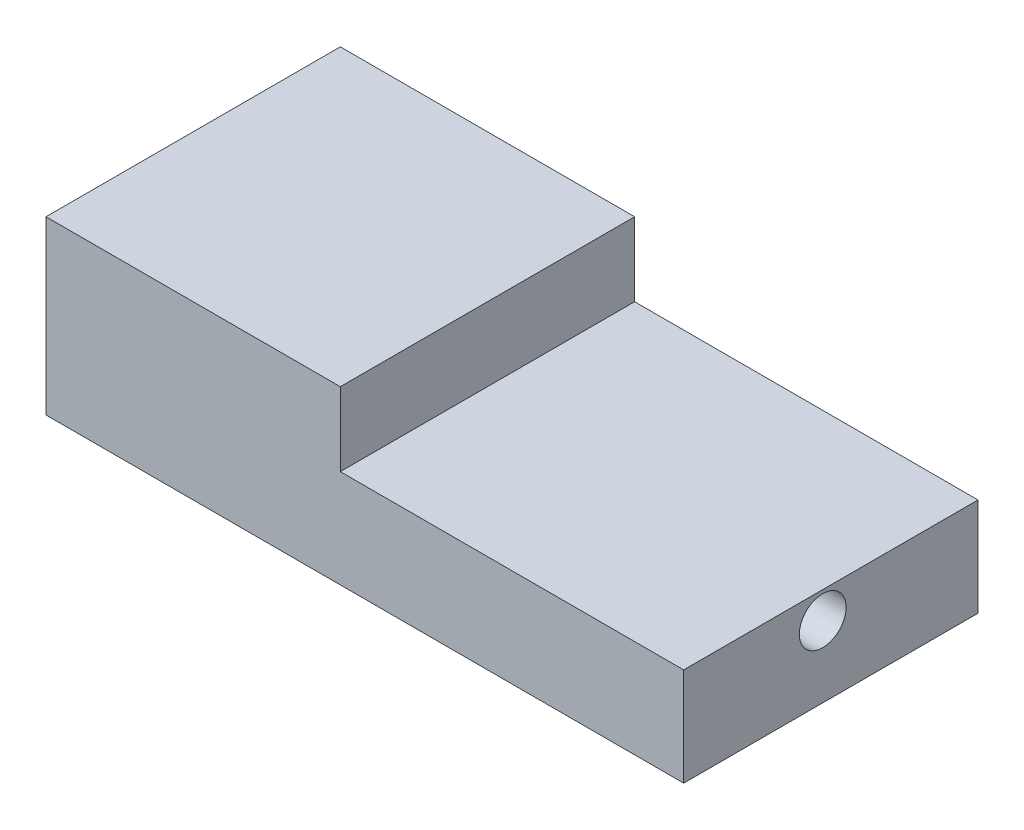
ISO-10303-21;
HEADER;
FILE_DESCRIPTION(('STEP AP214'),'2;1');
FILE_NAME('part.step','',(''),(''),'','','');
FILE_SCHEMA(('AUTOMOTIVE_DESIGN { 1 0 10303 214 1 1 1 1 }'));
ENDSEC;
DATA;
#1=APPLICATION_CONTEXT('core data for automotive mechanical design processes');
#2=APPLICATION_PROTOCOL_DEFINITION('international standard','automotive_design',2000,#1);
#3=PRODUCT_CONTEXT('',#1,'mechanical');
#4=PRODUCT('Part','Part','',(#3));
#5=PRODUCT_RELATED_PRODUCT_CATEGORY('part','',(#4));
#6=PRODUCT_DEFINITION_FORMATION('','',#4);
#7=PRODUCT_DEFINITION_CONTEXT('part definition',#1,'design');
#8=PRODUCT_DEFINITION('design','',#6,#7);
#9=PRODUCT_DEFINITION_SHAPE('','',#8);
#10=(LENGTH_UNIT() NAMED_UNIT(*) SI_UNIT(.MILLI.,.METRE.));
#11=(NAMED_UNIT(*) PLANE_ANGLE_UNIT() SI_UNIT($,.RADIAN.));
#12=(NAMED_UNIT(*) SI_UNIT($,.STERADIAN.) SOLID_ANGLE_UNIT());
#13=UNCERTAINTY_MEASURE_WITH_UNIT(LENGTH_MEASURE(1.E-05),#10,'distance_accuracy_value','');
#14=(GEOMETRIC_REPRESENTATION_CONTEXT(3) GLOBAL_UNCERTAINTY_ASSIGNED_CONTEXT((#13)) GLOBAL_UNIT_ASSIGNED_CONTEXT((#10,
#11,#12)) REPRESENTATION_CONTEXT('',''));
#15=CARTESIAN_POINT('',(0.,0.,0.));
#16=DIRECTION('',(0.,0.,1.));
#17=DIRECTION('',(1.,0.,0.));
#18=AXIS2_PLACEMENT_3D('',#15,#16,#17);
#19=CARTESIAN_POINT('',(130.,1.86602870813398,28.133971291866));
#20=DIRECTION('',(0.,-1.,0.));
#21=DIRECTION('',(0.,0.,-1.));
#22=AXIS2_PLACEMENT_3D('',#19,#20,#21);
#23=PLANE('',#22);
#24=DIRECTION('',(0.,0.,-1.));
#25=VECTOR('',#24,1.);
#26=CARTESIAN_POINT('',(60.,1.86602870813398,-31.866028708134));
#27=LINE('',#26,#25);
#28=CARTESIAN_POINT('',(60.,1.86602870813398,28.133971291866));
#29=VERTEX_POINT('',#28);
#30=CARTESIAN_POINT('',(60.,1.86602870813398,-31.866028708134));
#31=VERTEX_POINT('',#30);
#32=EDGE_CURVE('E55',#29,#31,#27,.T.);
#33=ORIENTED_EDGE('',*,*,#32,.F.);
#34=DIRECTION('',(-1.,0.,0.));
#35=VECTOR('',#34,1.);
#36=CARTESIAN_POINT('',(130.,1.86602870813398,28.133971291866));
#37=LINE('',#36,#35);
#38=CARTESIAN_POINT('',(130.,1.86602870813398,28.133971291866));
#39=VERTEX_POINT('',#38);
#40=EDGE_CURVE('E149',#39,#29,#37,.T.);
#41=ORIENTED_EDGE('',*,*,#40,.F.);
#42=DIRECTION('',(0.,0.,1.));
#43=VECTOR('',#42,1.);
#44=CARTESIAN_POINT('',(130.,1.86602870813398,28.133971291866));
#45=LINE('',#44,#43);
#46=CARTESIAN_POINT('',(130.,1.86602870813398,-31.866028708134));
#47=VERTEX_POINT('',#46);
#48=EDGE_CURVE('E64',#47,#39,#45,.T.);
#49=ORIENTED_EDGE('',*,*,#48,.F.);
#50=DIRECTION('',(-1.,0.,0.));
#51=VECTOR('',#50,1.);
#52=CARTESIAN_POINT('',(130.,1.86602870813398,-31.866028708134));
#53=LINE('',#52,#51);
#54=EDGE_CURVE('E157',#47,#31,#53,.T.);
#55=ORIENTED_EDGE('',*,*,#54,.T.);
#56=EDGE_LOOP('',(#33,#41,#49,#55));
#57=FACE_BOUND('',#56,.T.);
#58=ADVANCED_FACE('F38',(#57),#23,.F.);
#59=CARTESIAN_POINT('',(130.,1.86602870813398,28.133971291866));
#60=DIRECTION('',(0.,0.,-1.));
#61=DIRECTION('',(0.,1.,0.));
#62=AXIS2_PLACEMENT_3D('',#59,#60,#61);
#63=PLANE('',#62);
#64=DIRECTION('',(0.,-1.,0.));
#65=VECTOR('',#64,1.);
#66=CARTESIAN_POINT('',(0.,1.86602870813398,28.133971291866));
#67=LINE('',#66,#65);
#68=CARTESIAN_POINT('',(0.,16.866028708134,28.133971291866));
#69=VERTEX_POINT('',#68);
#70=CARTESIAN_POINT('',(0.,-18.133971291866,28.133971291866));
#71=VERTEX_POINT('',#70);
#72=EDGE_CURVE('E99',#69,#71,#67,.T.);
#73=ORIENTED_EDGE('',*,*,#72,.T.);
#74=DIRECTION('',(-1.,0.,0.));
#75=VECTOR('',#74,1.);
#76=CARTESIAN_POINT('',(130.,-18.133971291866,28.133971291866));
#77=LINE('',#76,#75);
#78=CARTESIAN_POINT('',(130.,-18.133971291866,28.133971291866));
#79=VERTEX_POINT('',#78);
#80=EDGE_CURVE('E11',#79,#71,#77,.T.);
#81=ORIENTED_EDGE('',*,*,#80,.F.);
#82=DIRECTION('',(0.,-1.,0.));
#83=VECTOR('',#82,1.);
#84=CARTESIAN_POINT('',(130.,1.86602870813398,28.133971291866));
#85=LINE('',#84,#83);
#86=EDGE_CURVE('E139',#39,#79,#85,.T.);
#87=ORIENTED_EDGE('',*,*,#86,.F.);
#88=ORIENTED_EDGE('',*,*,#40,.T.);
#89=DIRECTION('',(0.,-1.,0.));
#90=VECTOR('',#89,1.);
#91=CARTESIAN_POINT('',(60.,16.866028708134,28.133971291866));
#92=LINE('',#91,#90);
#93=CARTESIAN_POINT('',(60.,16.866028708134,28.133971291866));
#94=VERTEX_POINT('',#93);
#95=EDGE_CURVE('E108',#94,#29,#92,.T.);
#96=ORIENTED_EDGE('',*,*,#95,.F.);
#97=DIRECTION('',(1.,0.,0.));
#98=VECTOR('',#97,1.);
#99=CARTESIAN_POINT('',(0.,16.866028708134,28.133971291866));
#100=LINE('',#99,#98);
#101=EDGE_CURVE('E111',#69,#94,#100,.T.);
#102=ORIENTED_EDGE('',*,*,#101,.F.);
#103=EDGE_LOOP('',(#73,#81,#87,#88,#96,#102));
#104=FACE_BOUND('',#103,.T.);
#105=ADVANCED_FACE('F40',(#104),#63,.F.);
#106=CARTESIAN_POINT('',(130.,-18.133971291866,28.133971291866));
#107=DIRECTION('',(0.,1.,0.));
#108=DIRECTION('',(0.,0.,1.));
#109=AXIS2_PLACEMENT_3D('',#106,#107,#108);
#110=PLANE('',#109);
#111=DIRECTION('',(0.,0.,-1.));
#112=VECTOR('',#111,1.);
#113=CARTESIAN_POINT('',(0.,-18.133971291866,28.133971291866));
#114=LINE('',#113,#112);
#115=CARTESIAN_POINT('',(0.,-18.133971291866,-31.866028708134));
#116=VERTEX_POINT('',#115);
#117=EDGE_CURVE('E77',#71,#116,#114,.T.);
#118=ORIENTED_EDGE('',*,*,#117,.T.);
#119=DIRECTION('',(-1.,0.,0.));
#120=VECTOR('',#119,1.);
#121=CARTESIAN_POINT('',(130.,-18.133971291866,-31.866028708134));
#122=LINE('',#121,#120);
#123=CARTESIAN_POINT('',(130.,-18.133971291866,-31.866028708134));
#124=VERTEX_POINT('',#123);
#125=EDGE_CURVE('E48',#124,#116,#122,.T.);
#126=ORIENTED_EDGE('',*,*,#125,.F.);
#127=DIRECTION('',(0.,0.,-1.));
#128=VECTOR('',#127,1.);
#129=CARTESIAN_POINT('',(130.,-18.133971291866,28.133971291866));
#130=LINE('',#129,#128);
#131=EDGE_CURVE('E82',#79,#124,#130,.T.);
#132=ORIENTED_EDGE('',*,*,#131,.F.);
#133=ORIENTED_EDGE('',*,*,#80,.T.);
#134=EDGE_LOOP('',(#118,#126,#132,#133));
#135=FACE_BOUND('',#134,.T.);
#136=ADVANCED_FACE('F165',(#135),#110,.F.);
#137=CARTESIAN_POINT('',(130.,1.86602870813398,-31.866028708134));
#138=DIRECTION('',(0.,0.,1.));
#139=DIRECTION('',(1.,0.,0.));
#140=AXIS2_PLACEMENT_3D('',#137,#138,#139);
#141=PLANE('',#140);
#142=DIRECTION('',(0.,1.,0.));
#143=VECTOR('',#142,1.);
#144=CARTESIAN_POINT('',(0.,1.86602870813398,-31.866028708134));
#145=LINE('',#144,#143);
#146=CARTESIAN_POINT('',(0.,16.866028708134,-31.866028708134));
#147=VERTEX_POINT('',#146);
#148=EDGE_CURVE('E142',#116,#147,#145,.T.);
#149=ORIENTED_EDGE('',*,*,#148,.T.);
#150=DIRECTION('',(-1.,0.,0.));
#151=VECTOR('',#150,1.);
#152=CARTESIAN_POINT('',(0.,16.866028708134,-31.866028708134));
#153=LINE('',#152,#151);
#154=CARTESIAN_POINT('',(60.,16.866028708134,-31.866028708134));
#155=VERTEX_POINT('',#154);
#156=EDGE_CURVE('E121',#155,#147,#153,.T.);
#157=ORIENTED_EDGE('',*,*,#156,.F.);
#158=DIRECTION('',(0.,-1.,0.));
#159=VECTOR('',#158,1.);
#160=CARTESIAN_POINT('',(60.,16.866028708134,-31.866028708134));
#161=LINE('',#160,#159);
#162=EDGE_CURVE('E132',#155,#31,#161,.T.);
#163=ORIENTED_EDGE('',*,*,#162,.T.);
#164=ORIENTED_EDGE('',*,*,#54,.F.);
#165=DIRECTION('',(0.,1.,0.));
#166=VECTOR('',#165,1.);
#167=CARTESIAN_POINT('',(130.,1.86602870813398,-31.866028708134));
#168=LINE('',#167,#166);
#169=EDGE_CURVE('E145',#124,#47,#168,.T.);
#170=ORIENTED_EDGE('',*,*,#169,.F.);
#171=ORIENTED_EDGE('',*,*,#125,.T.);
#172=EDGE_LOOP('',(#149,#157,#163,#164,#170,#171));
#173=FACE_BOUND('',#172,.T.);
#174=ADVANCED_FACE('F163',(#173),#141,.F.);
#175=CARTESIAN_POINT('',(130.,0.,0.));
#176=DIRECTION('',(1.,0.,0.));
#177=DIRECTION('',(0.,0.,-1.));
#178=AXIS2_PLACEMENT_3D('',#175,#176,#177);
#179=PLANE('',#178);
#180=CARTESIAN_POINT('',(130.,-3.61187118164406,-0.210093722696383));
#181=DIRECTION('',(1.,0.,0.));
#182=DIRECTION('',(0.,0.,-1.));
#183=AXIS2_PLACEMENT_3D('',#180,#181,#182);
#184=CIRCLE('',#183,4.76720438262355);
#185=CARTESIAN_POINT('',(130.,-3.61187118164406,-4.97729810531994));
#186=VERTEX_POINT('',#185);
#187=EDGE_CURVE('E127',#186,#186,#184,.T.);
#188=ORIENTED_EDGE('',*,*,#187,.F.);
#189=EDGE_LOOP('',(#188));
#190=FACE_BOUND('',#189,.T.);
#191=ORIENTED_EDGE('',*,*,#86,.T.);
#192=ORIENTED_EDGE('',*,*,#131,.T.);
#193=ORIENTED_EDGE('',*,*,#169,.T.);
#194=ORIENTED_EDGE('',*,*,#48,.T.);
#195=EDGE_LOOP('',(#191,#192,#193,#194));
#196=FACE_BOUND('',#195,.T.);
#197=ADVANCED_FACE('F171',(#190,#196),#179,.T.);
#198=CARTESIAN_POINT('',(0.,0.,0.));
#199=DIRECTION('',(1.,0.,0.));
#200=DIRECTION('',(0.,0.,-1.));
#201=AXIS2_PLACEMENT_3D('',#198,#199,#200);
#202=PLANE('',#201);
#203=CARTESIAN_POINT('',(0.,-3.61187118164406,-0.210093722696383));
#204=DIRECTION('',(1.,0.,0.));
#205=DIRECTION('',(0.,0.,-1.));
#206=AXIS2_PLACEMENT_3D('',#203,#204,#205);
#207=CIRCLE('',#206,4.76720438262355);
#208=CARTESIAN_POINT('',(0.,-3.61187118164406,-4.97729810531994));
#209=VERTEX_POINT('',#208);
#210=EDGE_CURVE('E42',#209,#209,#207,.T.);
#211=ORIENTED_EDGE('',*,*,#210,.T.);
#212=EDGE_LOOP('',(#211));
#213=FACE_BOUND('',#212,.T.);
#214=ORIENTED_EDGE('',*,*,#72,.F.);
#215=DIRECTION('',(0.,0.,1.));
#216=VECTOR('',#215,1.);
#217=CARTESIAN_POINT('',(0.,16.866028708134,-31.866028708134));
#218=LINE('',#217,#216);
#219=EDGE_CURVE('E104',#147,#69,#218,.T.);
#220=ORIENTED_EDGE('',*,*,#219,.F.);
#221=ORIENTED_EDGE('',*,*,#148,.F.);
#222=ORIENTED_EDGE('',*,*,#117,.F.);
#223=EDGE_LOOP('',(#214,#220,#221,#222));
#224=FACE_BOUND('',#223,.T.);
#225=ADVANCED_FACE('F101',(#213,#224),#202,.F.);
#226=CARTESIAN_POINT('',(60.,16.866028708134,-31.866028708134));
#227=DIRECTION('',(-1.,0.,0.));
#228=DIRECTION('',(0.,0.,1.));
#229=AXIS2_PLACEMENT_3D('',#226,#227,#228);
#230=PLANE('',#229);
#231=ORIENTED_EDGE('',*,*,#32,.T.);
#232=ORIENTED_EDGE('',*,*,#162,.F.);
#233=DIRECTION('',(0.,0.,-1.));
#234=VECTOR('',#233,1.);
#235=CARTESIAN_POINT('',(60.,16.866028708134,-31.866028708134));
#236=LINE('',#235,#234);
#237=EDGE_CURVE('E116',#94,#155,#236,.T.);
#238=ORIENTED_EDGE('',*,*,#237,.F.);
#239=ORIENTED_EDGE('',*,*,#95,.T.);
#240=EDGE_LOOP('',(#231,#232,#238,#239));
#241=FACE_BOUND('',#240,.T.);
#242=ADVANCED_FACE('F180',(#241),#230,.F.);
#243=CARTESIAN_POINT('',(0.,16.866028708134,0.));
#244=DIRECTION('',(0.,1.,0.));
#245=DIRECTION('',(0.,0.,1.));
#246=AXIS2_PLACEMENT_3D('',#243,#244,#245);
#247=PLANE('',#246);
#248=ORIENTED_EDGE('',*,*,#219,.T.);
#249=ORIENTED_EDGE('',*,*,#101,.T.);
#250=ORIENTED_EDGE('',*,*,#237,.T.);
#251=ORIENTED_EDGE('',*,*,#156,.T.);
#252=EDGE_LOOP('',(#248,#249,#250,#251));
#253=FACE_BOUND('',#252,.T.);
#254=ADVANCED_FACE('F119',(#253),#247,.T.);
#255=CARTESIAN_POINT('',(-70.,-3.61187118164406,-0.210093722696383));
#256=DIRECTION('',(1.,0.,0.));
#257=DIRECTION('',(0.,0.,-1.));
#258=AXIS2_PLACEMENT_3D('',#255,#256,#257);
#259=CYLINDRICAL_SURFACE('',#258,4.76720438262355);
#260=ORIENTED_EDGE('',*,*,#187,.T.);
#261=EDGE_LOOP('',(#260));
#262=FACE_BOUND('',#261,.T.);
#263=ORIENTED_EDGE('',*,*,#210,.F.);
#264=EDGE_LOOP('',(#263));
#265=FACE_BOUND('',#264,.T.);
#266=ADVANCED_FACE('F190',(#262,#265),#259,.F.);
#267=CLOSED_SHELL('',(#58,#105,#136,#174,#197,#225,#242,#254,#266));
#268=MANIFOLD_SOLID_BREP('B2',#267);
#269=ADVANCED_BREP_SHAPE_REPRESENTATION('',(#18,#268),#14);
#270=SHAPE_DEFINITION_REPRESENTATION(#9,#269);
ENDSEC;
END-ISO-10303-21;
